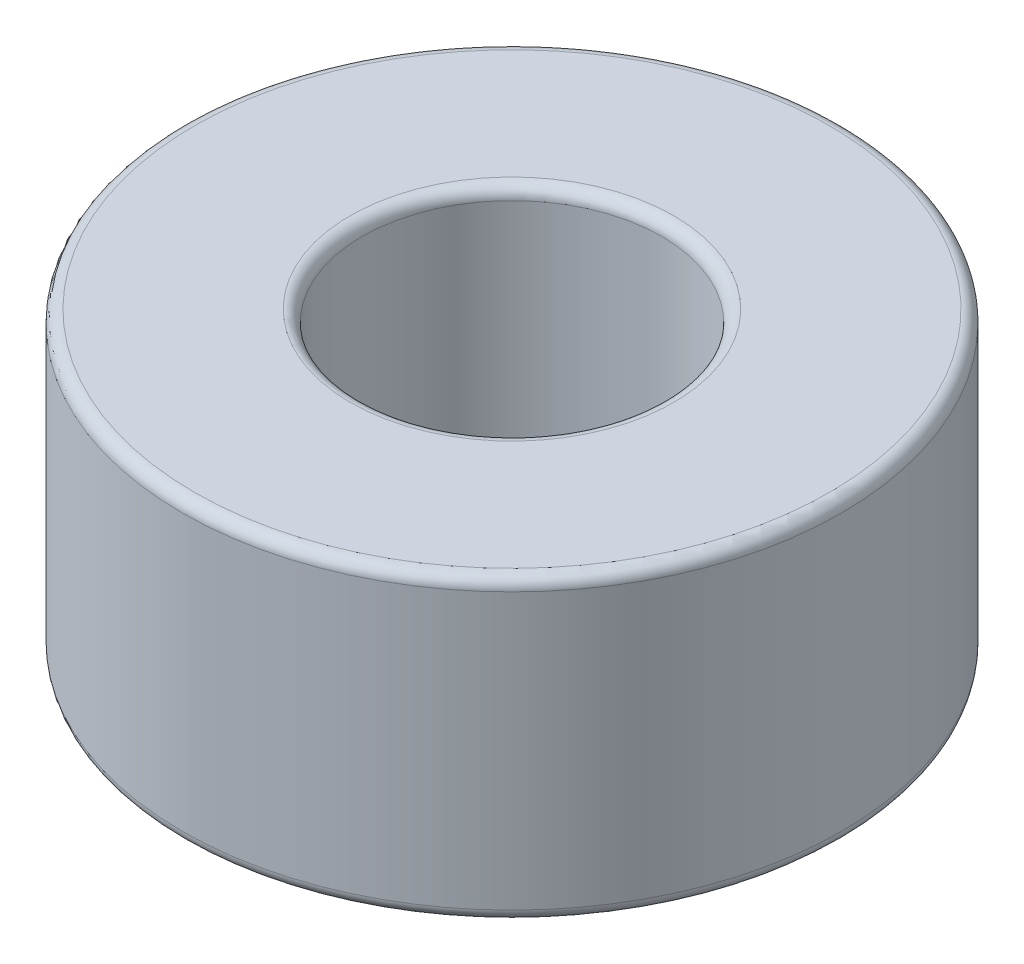
ISO-10303-21;
HEADER;
FILE_DESCRIPTION(('STEP AP214'),'2;1');
FILE_NAME('part.step','',(''),(''),'','','');
FILE_SCHEMA(('AUTOMOTIVE_DESIGN { 1 0 10303 214 1 1 1 1 }'));
ENDSEC;
DATA;
#1=APPLICATION_CONTEXT('core data for automotive mechanical design processes');
#2=APPLICATION_PROTOCOL_DEFINITION('international standard','automotive_design',2000,#1);
#3=PRODUCT_CONTEXT('',#1,'mechanical');
#4=PRODUCT('Part','Part','',(#3));
#5=PRODUCT_RELATED_PRODUCT_CATEGORY('part','',(#4));
#6=PRODUCT_DEFINITION_FORMATION('','',#4);
#7=PRODUCT_DEFINITION_CONTEXT('part definition',#1,'design');
#8=PRODUCT_DEFINITION('design','',#6,#7);
#9=PRODUCT_DEFINITION_SHAPE('','',#8);
#10=(LENGTH_UNIT() NAMED_UNIT(*) SI_UNIT(.MILLI.,.METRE.));
#11=(NAMED_UNIT(*) PLANE_ANGLE_UNIT() SI_UNIT($,.RADIAN.));
#12=(NAMED_UNIT(*) SI_UNIT($,.STERADIAN.) SOLID_ANGLE_UNIT());
#13=UNCERTAINTY_MEASURE_WITH_UNIT(LENGTH_MEASURE(1.E-05),#10,'distance_accuracy_value','');
#14=(GEOMETRIC_REPRESENTATION_CONTEXT(3) GLOBAL_UNCERTAINTY_ASSIGNED_CONTEXT((#13)) GLOBAL_UNIT_ASSIGNED_CONTEXT((#10,
#11,#12)) REPRESENTATION_CONTEXT('',''));
#15=CARTESIAN_POINT('',(0.,0.,0.));
#16=DIRECTION('',(0.,0.,1.));
#17=DIRECTION('',(1.,0.,0.));
#18=AXIS2_PLACEMENT_3D('',#15,#16,#17);
#19=CARTESIAN_POINT('',(0.,4.8,0.));
#20=DIRECTION('',(0.,1.,0.));
#21=DIRECTION('',(-1.,0.,0.));
#22=AXIS2_PLACEMENT_3D('',#19,#20,#21);
#23=TOROIDAL_SURFACE('',#22,5.3,0.2);
#24=CARTESIAN_POINT('',(0.,4.8,0.));
#25=DIRECTION('',(0.,1.,0.));
#26=DIRECTION('',(0.,0.,1.));
#27=AXIS2_PLACEMENT_3D('',#24,#25,#26);
#28=CIRCLE('',#27,5.5);
#29=CARTESIAN_POINT('',(0.,4.8,5.5));
#30=VERTEX_POINT('',#29);
#31=EDGE_CURVE('E30',#30,#30,#28,.T.);
#32=ORIENTED_EDGE('',*,*,#31,.T.);
#33=EDGE_LOOP('',(#32));
#34=FACE_BOUND('',#33,.T.);
#35=CARTESIAN_POINT('',(0.,5.,0.));
#36=DIRECTION('',(0.,1.,0.));
#37=DIRECTION('',(0.,0.,1.));
#38=AXIS2_PLACEMENT_3D('',#35,#36,#37);
#39=CIRCLE('',#38,5.3);
#40=CARTESIAN_POINT('',(0.,5.,5.3));
#41=VERTEX_POINT('',#40);
#42=EDGE_CURVE('E9',#41,#41,#39,.T.);
#43=ORIENTED_EDGE('',*,*,#42,.F.);
#44=EDGE_LOOP('',(#43));
#45=FACE_BOUND('',#44,.T.);
#46=ADVANCED_FACE('F14',(#34,#45),#23,.T.);
#47=CARTESIAN_POINT('',(0.,5.,0.));
#48=DIRECTION('',(0.,1.,0.));
#49=DIRECTION('',(0.,0.,1.));
#50=AXIS2_PLACEMENT_3D('',#47,#48,#49);
#51=PLANE('',#50);
#52=ORIENTED_EDGE('',*,*,#42,.T.);
#53=EDGE_LOOP('',(#52));
#54=FACE_BOUND('',#53,.T.);
#55=CARTESIAN_POINT('',(0.,5.,0.));
#56=DIRECTION('',(0.,1.,0.));
#57=DIRECTION('',(0.,0.,1.));
#58=AXIS2_PLACEMENT_3D('',#55,#56,#57);
#59=CIRCLE('',#58,2.70000000000003);
#60=CARTESIAN_POINT('',(0.,5.,2.70000000000002));
#61=VERTEX_POINT('',#60);
#62=EDGE_CURVE('E22',#61,#61,#59,.T.);
#63=ORIENTED_EDGE('',*,*,#62,.F.);
#64=EDGE_LOOP('',(#63));
#65=FACE_BOUND('',#64,.T.);
#66=ADVANCED_FACE('F71',(#54,#65),#51,.T.);
#67=CARTESIAN_POINT('',(0.,4.8,0.));
#68=DIRECTION('',(0.,1.,0.));
#69=DIRECTION('',(-0.592052972485471,0.,-0.805899049367301));
#70=AXIS2_PLACEMENT_3D('',#67,#68,#69);
#71=TOROIDAL_SURFACE('',#70,2.7,0.2);
#72=ORIENTED_EDGE('',*,*,#62,.T.);
#73=EDGE_LOOP('',(#72));
#74=FACE_BOUND('',#73,.T.);
#75=CARTESIAN_POINT('',(0.,4.8,0.));
#76=DIRECTION('',(0.,1.,0.));
#77=DIRECTION('',(0.,0.,1.));
#78=AXIS2_PLACEMENT_3D('',#75,#76,#77);
#79=CIRCLE('',#78,2.5);
#80=CARTESIAN_POINT('',(0.,4.8,2.50000000000004));
#81=VERTEX_POINT('',#80);
#82=EDGE_CURVE('E27',#81,#81,#79,.T.);
#83=ORIENTED_EDGE('',*,*,#82,.F.);
#84=EDGE_LOOP('',(#83));
#85=FACE_BOUND('',#84,.T.);
#86=ADVANCED_FACE('F67',(#74,#85),#71,.T.);
#87=CARTESIAN_POINT('',(0.,4.9,0.));
#88=DIRECTION('',(0.,-1.,0.));
#89=DIRECTION('',(0.,0.,-1.));
#90=AXIS2_PLACEMENT_3D('',#87,#88,#89);
#91=CYLINDRICAL_SURFACE('',#90,2.5);
#92=ORIENTED_EDGE('',*,*,#82,.T.);
#93=EDGE_LOOP('',(#92));
#94=FACE_BOUND('',#93,.T.);
#95=CARTESIAN_POINT('',(0.,0.2,0.));
#96=DIRECTION('',(0.,1.,0.));
#97=DIRECTION('',(0.,0.,-1.));
#98=AXIS2_PLACEMENT_3D('',#95,#96,#97);
#99=CIRCLE('',#98,2.5);
#100=CARTESIAN_POINT('',(0.,0.2,-2.5));
#101=VERTEX_POINT('',#100);
#102=EDGE_CURVE('E36',#101,#101,#99,.T.);
#103=ORIENTED_EDGE('',*,*,#102,.F.);
#104=EDGE_LOOP('',(#103));
#105=FACE_BOUND('',#104,.T.);
#106=ADVANCED_FACE('F57',(#94,#105),#91,.F.);
#107=CARTESIAN_POINT('',(0.,0.2,0.));
#108=DIRECTION('',(0.,1.,0.));
#109=DIRECTION('',(-0.644526808964638,0.,-0.764581710823546));
#110=AXIS2_PLACEMENT_3D('',#107,#108,#109);
#111=TOROIDAL_SURFACE('',#110,2.7,0.2);
#112=ORIENTED_EDGE('',*,*,#102,.T.);
#113=EDGE_LOOP('',(#112));
#114=FACE_BOUND('',#113,.T.);
#115=CARTESIAN_POINT('',(0.,0.,0.));
#116=DIRECTION('',(0.,1.,0.));
#117=DIRECTION('',(0.,0.,1.));
#118=AXIS2_PLACEMENT_3D('',#115,#116,#117);
#119=CIRCLE('',#118,2.7);
#120=CARTESIAN_POINT('',(0.,0.,2.7));
#121=VERTEX_POINT('',#120);
#122=EDGE_CURVE('E32',#121,#121,#119,.T.);
#123=ORIENTED_EDGE('',*,*,#122,.F.);
#124=EDGE_LOOP('',(#123));
#125=FACE_BOUND('',#124,.T.);
#126=ADVANCED_FACE('F55',(#114,#125),#111,.T.);
#127=CARTESIAN_POINT('',(0.,2.5,0.));
#128=DIRECTION('',(0.,1.,0.));
#129=DIRECTION('',(0.,0.,1.));
#130=AXIS2_PLACEMENT_3D('',#127,#128,#129);
#131=CYLINDRICAL_SURFACE('',#130,5.5);
#132=ORIENTED_EDGE('',*,*,#31,.F.);
#133=EDGE_LOOP('',(#132));
#134=FACE_BOUND('',#133,.T.);
#135=CARTESIAN_POINT('',(0.,0.2,0.));
#136=DIRECTION('',(0.,1.,0.));
#137=DIRECTION('',(0.,0.,1.));
#138=AXIS2_PLACEMENT_3D('',#135,#136,#137);
#139=CIRCLE('',#138,5.5);
#140=CARTESIAN_POINT('',(0.,0.2,5.5));
#141=VERTEX_POINT('',#140);
#142=EDGE_CURVE('E40',#141,#141,#139,.T.);
#143=ORIENTED_EDGE('',*,*,#142,.T.);
#144=EDGE_LOOP('',(#143));
#145=FACE_BOUND('',#144,.T.);
#146=ADVANCED_FACE('F52',(#134,#145),#131,.T.);
#147=CARTESIAN_POINT('',(0.,0.,0.));
#148=DIRECTION('',(0.,1.,0.));
#149=DIRECTION('',(0.,0.,1.));
#150=AXIS2_PLACEMENT_3D('',#147,#148,#149);
#151=PLANE('',#150);
#152=CARTESIAN_POINT('',(3.42281758491936E-13,0.,0.));
#153=DIRECTION('',(0.,1.,0.));
#154=DIRECTION('',(0.,0.,1.));
#155=AXIS2_PLACEMENT_3D('',#152,#153,#154);
#156=CIRCLE('',#155,5.30000000000023);
#157=CARTESIAN_POINT('',(3.42281758491936E-13,0.,5.30000000000017));
#158=VERTEX_POINT('',#157);
#159=EDGE_CURVE('E18',#158,#158,#156,.T.);
#160=ORIENTED_EDGE('',*,*,#159,.F.);
#161=EDGE_LOOP('',(#160));
#162=FACE_BOUND('',#161,.T.);
#163=ORIENTED_EDGE('',*,*,#122,.T.);
#164=EDGE_LOOP('',(#163));
#165=FACE_BOUND('',#164,.T.);
#166=ADVANCED_FACE('F49',(#162,#165),#151,.F.);
#167=CARTESIAN_POINT('',(4.2321701698711E-13,0.2,-9.13047415451729E-13));
#168=DIRECTION('',(0.,1.,0.));
#169=DIRECTION('',(-1.,0.,1.72356887671971E-13));
#170=AXIS2_PLACEMENT_3D('',#167,#168,#169);
#171=TOROIDAL_SURFACE('',#170,5.30000000000076,0.2);
#172=ORIENTED_EDGE('',*,*,#159,.T.);
#173=EDGE_LOOP('',(#172));
#174=FACE_BOUND('',#173,.T.);
#175=ORIENTED_EDGE('',*,*,#142,.F.);
#176=EDGE_LOOP('',(#175));
#177=FACE_BOUND('',#176,.T.);
#178=ADVANCED_FACE('F16',(#174,#177),#171,.T.);
#179=CLOSED_SHELL('',(#46,#66,#86,#106,#126,#146,#166,#178));
#180=MANIFOLD_SOLID_BREP('B1',#179);
#181=ADVANCED_BREP_SHAPE_REPRESENTATION('',(#18,#180),#14);
#182=SHAPE_DEFINITION_REPRESENTATION(#9,#181);
ENDSEC;
END-ISO-10303-21;
